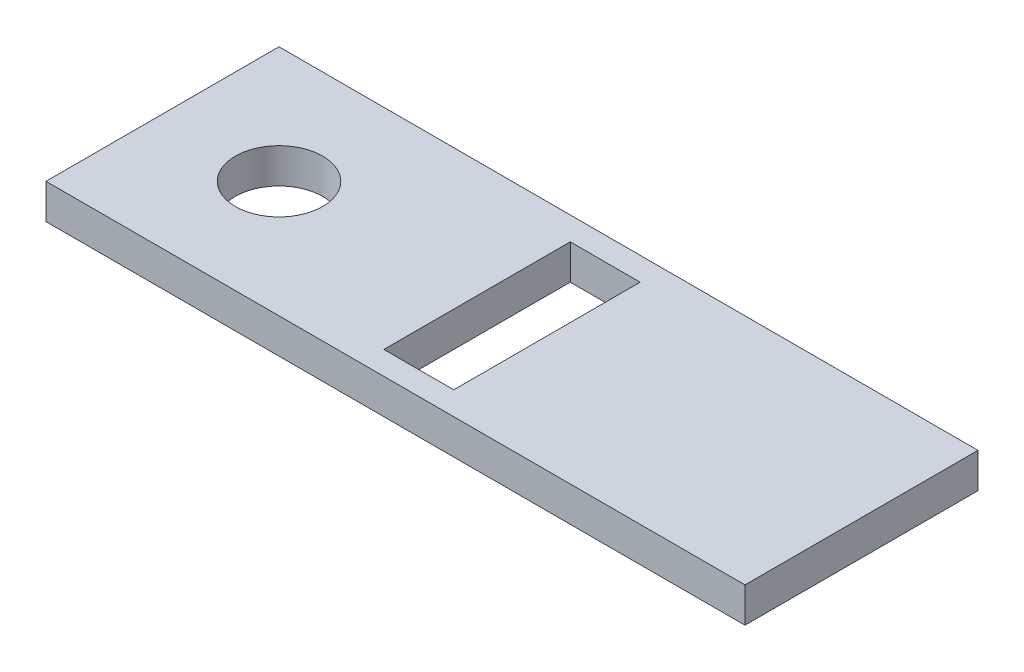
ISO-10303-21;
HEADER;
FILE_DESCRIPTION(('STEP AP214'),'2;1');
FILE_NAME('part.step','',(''),(''),'','','');
FILE_SCHEMA(('AUTOMOTIVE_DESIGN { 1 0 10303 214 1 1 1 1 }'));
ENDSEC;
DATA;
#1=APPLICATION_CONTEXT('core data for automotive mechanical design processes');
#2=APPLICATION_PROTOCOL_DEFINITION('international standard','automotive_design',2000,#1);
#3=PRODUCT_CONTEXT('',#1,'mechanical');
#4=PRODUCT('Part','Part','',(#3));
#5=PRODUCT_RELATED_PRODUCT_CATEGORY('part','',(#4));
#6=PRODUCT_DEFINITION_FORMATION('','',#4);
#7=PRODUCT_DEFINITION_CONTEXT('part definition',#1,'design');
#8=PRODUCT_DEFINITION('design','',#6,#7);
#9=PRODUCT_DEFINITION_SHAPE('','',#8);
#10=(LENGTH_UNIT() NAMED_UNIT(*) SI_UNIT(.MILLI.,.METRE.));
#11=(NAMED_UNIT(*) PLANE_ANGLE_UNIT() SI_UNIT($,.RADIAN.));
#12=(NAMED_UNIT(*) SI_UNIT($,.STERADIAN.) SOLID_ANGLE_UNIT());
#13=UNCERTAINTY_MEASURE_WITH_UNIT(LENGTH_MEASURE(1.E-05),#10,'distance_accuracy_value','');
#14=(GEOMETRIC_REPRESENTATION_CONTEXT(3) GLOBAL_UNCERTAINTY_ASSIGNED_CONTEXT((#13)) GLOBAL_UNIT_ASSIGNED_CONTEXT((#10,
#11,#12)) REPRESENTATION_CONTEXT('',''));
#15=CARTESIAN_POINT('',(0.,0.,0.));
#16=DIRECTION('',(0.,0.,1.));
#17=DIRECTION('',(1.,0.,0.));
#18=AXIS2_PLACEMENT_3D('',#15,#16,#17);
#19=CARTESIAN_POINT('',(-76.2,7.62,25.4));
#20=DIRECTION('',(-1.,0.,0.));
#21=DIRECTION('',(0.,0.,1.));
#22=AXIS2_PLACEMENT_3D('',#19,#20,#21);
#23=PLANE('',#22);
#24=DIRECTION('',(0.,0.,-1.));
#25=VECTOR('',#24,1.);
#26=CARTESIAN_POINT('',(-76.2,0.,25.4));
#27=LINE('',#26,#25);
#28=CARTESIAN_POINT('',(-76.2,0.,25.4));
#29=VERTEX_POINT('',#28);
#30=CARTESIAN_POINT('',(-76.2,0.,-25.4));
#31=VERTEX_POINT('',#30);
#32=EDGE_CURVE('E138',#29,#31,#27,.T.);
#33=ORIENTED_EDGE('',*,*,#32,.F.);
#34=DIRECTION('',(0.,-1.,0.));
#35=VECTOR('',#34,1.);
#36=CARTESIAN_POINT('',(-76.2,7.62,25.4));
#37=LINE('',#36,#35);
#38=CARTESIAN_POINT('',(-76.2,7.62,25.4));
#39=VERTEX_POINT('',#38);
#40=EDGE_CURVE('E11',#39,#29,#37,.T.);
#41=ORIENTED_EDGE('',*,*,#40,.F.);
#42=DIRECTION('',(0.,0.,-1.));
#43=VECTOR('',#42,1.);
#44=CARTESIAN_POINT('',(-76.2,7.62,25.4));
#45=LINE('',#44,#43);
#46=CARTESIAN_POINT('',(-76.2,7.62,-25.4));
#47=VERTEX_POINT('',#46);
#48=EDGE_CURVE('E141',#39,#47,#45,.T.);
#49=ORIENTED_EDGE('',*,*,#48,.T.);
#50=DIRECTION('',(0.,-1.,0.));
#51=VECTOR('',#50,1.);
#52=CARTESIAN_POINT('',(-76.2,7.62,-25.4));
#53=LINE('',#52,#51);
#54=EDGE_CURVE('E36',#47,#31,#53,.T.);
#55=ORIENTED_EDGE('',*,*,#54,.T.);
#56=EDGE_LOOP('',(#33,#41,#49,#55));
#57=FACE_BOUND('',#56,.T.);
#58=ADVANCED_FACE('F33',(#57),#23,.T.);
#59=CARTESIAN_POINT('',(-76.2,7.62,25.4));
#60=DIRECTION('',(0.,0.,-1.));
#61=DIRECTION('',(-1.,0.,0.));
#62=AXIS2_PLACEMENT_3D('',#59,#60,#61);
#63=PLANE('',#62);
#64=DIRECTION('',(1.,0.,0.));
#65=VECTOR('',#64,1.);
#66=CARTESIAN_POINT('',(-76.2,0.,25.4));
#67=LINE('',#66,#65);
#68=CARTESIAN_POINT('',(76.2,0.,25.4));
#69=VERTEX_POINT('',#68);
#70=EDGE_CURVE('E145',#29,#69,#67,.T.);
#71=ORIENTED_EDGE('',*,*,#70,.T.);
#72=DIRECTION('',(0.,-1.,0.));
#73=VECTOR('',#72,1.);
#74=CARTESIAN_POINT('',(76.2,7.62,25.4));
#75=LINE('',#74,#73);
#76=CARTESIAN_POINT('',(76.2,7.62,25.4));
#77=VERTEX_POINT('',#76);
#78=EDGE_CURVE('E41',#77,#69,#75,.T.);
#79=ORIENTED_EDGE('',*,*,#78,.F.);
#80=DIRECTION('',(1.,0.,0.));
#81=VECTOR('',#80,1.);
#82=CARTESIAN_POINT('',(-76.2,7.62,25.4));
#83=LINE('',#82,#81);
#84=EDGE_CURVE('E150',#39,#77,#83,.T.);
#85=ORIENTED_EDGE('',*,*,#84,.F.);
#86=ORIENTED_EDGE('',*,*,#40,.T.);
#87=EDGE_LOOP('',(#71,#79,#85,#86));
#88=FACE_BOUND('',#87,.T.);
#89=ADVANCED_FACE('F176',(#88),#63,.F.);
#90=CARTESIAN_POINT('',(76.2,7.62,25.4));
#91=DIRECTION('',(-1.,0.,0.));
#92=DIRECTION('',(0.,0.,1.));
#93=AXIS2_PLACEMENT_3D('',#90,#91,#92);
#94=PLANE('',#93);
#95=DIRECTION('',(0.,0.,-1.));
#96=VECTOR('',#95,1.);
#97=CARTESIAN_POINT('',(76.2,0.,25.4));
#98=LINE('',#97,#96);
#99=CARTESIAN_POINT('',(76.2,0.,-25.4));
#100=VERTEX_POINT('',#99);
#101=EDGE_CURVE('E157',#69,#100,#98,.T.);
#102=ORIENTED_EDGE('',*,*,#101,.T.);
#103=DIRECTION('',(0.,-1.,0.));
#104=VECTOR('',#103,1.);
#105=CARTESIAN_POINT('',(76.2,7.62,-25.4));
#106=LINE('',#105,#104);
#107=CARTESIAN_POINT('',(76.2,7.62,-25.4));
#108=VERTEX_POINT('',#107);
#109=EDGE_CURVE('E162',#108,#100,#106,.T.);
#110=ORIENTED_EDGE('',*,*,#109,.F.);
#111=DIRECTION('',(0.,0.,-1.));
#112=VECTOR('',#111,1.);
#113=CARTESIAN_POINT('',(76.2,7.62,25.4));
#114=LINE('',#113,#112);
#115=EDGE_CURVE('E148',#77,#108,#114,.T.);
#116=ORIENTED_EDGE('',*,*,#115,.F.);
#117=ORIENTED_EDGE('',*,*,#78,.T.);
#118=EDGE_LOOP('',(#102,#110,#116,#117));
#119=FACE_BOUND('',#118,.T.);
#120=ADVANCED_FACE('F180',(#119),#94,.F.);
#121=CARTESIAN_POINT('',(-76.2,7.62,-25.4));
#122=DIRECTION('',(0.,0.,-1.));
#123=DIRECTION('',(-1.,0.,0.));
#124=AXIS2_PLACEMENT_3D('',#121,#122,#123);
#125=PLANE('',#124);
#126=DIRECTION('',(1.,0.,0.));
#127=VECTOR('',#126,1.);
#128=CARTESIAN_POINT('',(-76.2,0.,-25.4));
#129=LINE('',#128,#127);
#130=EDGE_CURVE('E154',#31,#100,#129,.T.);
#131=ORIENTED_EDGE('',*,*,#130,.F.);
#132=ORIENTED_EDGE('',*,*,#54,.F.);
#133=DIRECTION('',(1.,0.,0.));
#134=VECTOR('',#133,1.);
#135=CARTESIAN_POINT('',(-76.2,7.62,-25.4));
#136=LINE('',#135,#134);
#137=EDGE_CURVE('E144',#47,#108,#136,.T.);
#138=ORIENTED_EDGE('',*,*,#137,.T.);
#139=ORIENTED_EDGE('',*,*,#109,.T.);
#140=EDGE_LOOP('',(#131,#132,#138,#139));
#141=FACE_BOUND('',#140,.T.);
#142=ADVANCED_FACE('F170',(#141),#125,.T.);
#143=CARTESIAN_POINT('',(0.,7.62,0.));
#144=DIRECTION('',(0.,-1.,0.));
#145=DIRECTION('',(0.,0.,-1.));
#146=AXIS2_PLACEMENT_3D('',#143,#144,#145);
#147=PLANE('',#146);
#148=DIRECTION('',(-1.,0.,0.));
#149=VECTOR('',#148,1.);
#150=CARTESIAN_POINT('',(-7.62,7.62,-20.32));
#151=LINE('',#150,#149);
#152=CARTESIAN_POINT('',(7.62,7.62,-20.32));
#153=VERTEX_POINT('',#152);
#154=CARTESIAN_POINT('',(-7.62,7.62,-20.32));
#155=VERTEX_POINT('',#154);
#156=EDGE_CURVE('E125',#153,#155,#151,.T.);
#157=ORIENTED_EDGE('',*,*,#156,.F.);
#158=DIRECTION('',(0.,0.,-1.));
#159=VECTOR('',#158,1.);
#160=CARTESIAN_POINT('',(7.62,7.62,20.32));
#161=LINE('',#160,#159);
#162=CARTESIAN_POINT('',(7.62,7.62,20.32));
#163=VERTEX_POINT('',#162);
#164=EDGE_CURVE('E49',#163,#153,#161,.T.);
#165=ORIENTED_EDGE('',*,*,#164,.F.);
#166=DIRECTION('',(1.,0.,0.));
#167=VECTOR('',#166,1.);
#168=CARTESIAN_POINT('',(-7.62,7.62,20.32));
#169=LINE('',#168,#167);
#170=CARTESIAN_POINT('',(-7.62,7.62,20.32));
#171=VERTEX_POINT('',#170);
#172=EDGE_CURVE('E116',#171,#163,#169,.T.);
#173=ORIENTED_EDGE('',*,*,#172,.F.);
#174=DIRECTION('',(0.,0.,1.));
#175=VECTOR('',#174,1.);
#176=CARTESIAN_POINT('',(-7.62,7.62,20.32));
#177=LINE('',#176,#175);
#178=EDGE_CURVE('E119',#155,#171,#177,.T.);
#179=ORIENTED_EDGE('',*,*,#178,.F.);
#180=EDGE_LOOP('',(#157,#165,#173,#179));
#181=FACE_BOUND('',#180,.T.);
#182=CARTESIAN_POINT('',(-50.8,7.62,0.));
#183=DIRECTION('',(0.,1.,0.));
#184=DIRECTION('',(0.,0.,1.));
#185=AXIS2_PLACEMENT_3D('',#182,#183,#184);
#186=CIRCLE('',#185,9.525);
#187=CARTESIAN_POINT('',(-50.8,7.62,9.525));
#188=VERTEX_POINT('',#187);
#189=EDGE_CURVE('E131',#188,#188,#186,.T.);
#190=ORIENTED_EDGE('',*,*,#189,.F.);
#191=EDGE_LOOP('',(#190));
#192=FACE_BOUND('',#191,.T.);
#193=ORIENTED_EDGE('',*,*,#48,.F.);
#194=ORIENTED_EDGE('',*,*,#84,.T.);
#195=ORIENTED_EDGE('',*,*,#115,.T.);
#196=ORIENTED_EDGE('',*,*,#137,.F.);
#197=EDGE_LOOP('',(#193,#194,#195,#196));
#198=FACE_BOUND('',#197,.T.);
#199=ADVANCED_FACE('F182',(#181,#192,#198),#147,.F.);
#200=CARTESIAN_POINT('',(0.,0.,0.));
#201=DIRECTION('',(0.,-1.,0.));
#202=DIRECTION('',(0.,0.,-1.));
#203=AXIS2_PLACEMENT_3D('',#200,#201,#202);
#204=PLANE('',#203);
#205=DIRECTION('',(0.,0.,-1.));
#206=VECTOR('',#205,1.);
#207=CARTESIAN_POINT('',(7.62,0.,20.32));
#208=LINE('',#207,#206);
#209=CARTESIAN_POINT('',(7.62,0.,20.32));
#210=VERTEX_POINT('',#209);
#211=CARTESIAN_POINT('',(7.62,0.,-20.32));
#212=VERTEX_POINT('',#211);
#213=EDGE_CURVE('E100',#210,#212,#208,.T.);
#214=ORIENTED_EDGE('',*,*,#213,.T.);
#215=DIRECTION('',(-1.,0.,0.));
#216=VECTOR('',#215,1.);
#217=CARTESIAN_POINT('',(-7.62,0.,-20.32));
#218=LINE('',#217,#216);
#219=CARTESIAN_POINT('',(-7.62,0.,-20.32));
#220=VERTEX_POINT('',#219);
#221=EDGE_CURVE('E109',#212,#220,#218,.T.);
#222=ORIENTED_EDGE('',*,*,#221,.T.);
#223=DIRECTION('',(0.,0.,1.));
#224=VECTOR('',#223,1.);
#225=CARTESIAN_POINT('',(-7.62,0.,20.32));
#226=LINE('',#225,#224);
#227=CARTESIAN_POINT('',(-7.62,0.,20.32));
#228=VERTEX_POINT('',#227);
#229=EDGE_CURVE('E57',#220,#228,#226,.T.);
#230=ORIENTED_EDGE('',*,*,#229,.T.);
#231=DIRECTION('',(1.,0.,0.));
#232=VECTOR('',#231,1.);
#233=CARTESIAN_POINT('',(-7.62,0.,20.32));
#234=LINE('',#233,#232);
#235=EDGE_CURVE('E106',#228,#210,#234,.T.);
#236=ORIENTED_EDGE('',*,*,#235,.T.);
#237=EDGE_LOOP('',(#214,#222,#230,#236));
#238=FACE_BOUND('',#237,.T.);
#239=CARTESIAN_POINT('',(-50.8,0.,0.));
#240=DIRECTION('',(0.,1.,0.));
#241=DIRECTION('',(0.,0.,1.));
#242=AXIS2_PLACEMENT_3D('',#239,#240,#241);
#243=CIRCLE('',#242,9.525);
#244=CARTESIAN_POINT('',(-50.8,0.,9.525));
#245=VERTEX_POINT('',#244);
#246=EDGE_CURVE('E135',#245,#245,#243,.T.);
#247=ORIENTED_EDGE('',*,*,#246,.T.);
#248=EDGE_LOOP('',(#247));
#249=FACE_BOUND('',#248,.T.);
#250=ORIENTED_EDGE('',*,*,#32,.T.);
#251=ORIENTED_EDGE('',*,*,#130,.T.);
#252=ORIENTED_EDGE('',*,*,#101,.F.);
#253=ORIENTED_EDGE('',*,*,#70,.F.);
#254=EDGE_LOOP('',(#250,#251,#252,#253));
#255=FACE_BOUND('',#254,.T.);
#256=ADVANCED_FACE('F113',(#238,#249,#255),#204,.T.);
#257=CARTESIAN_POINT('',(-50.8,0.,0.));
#258=DIRECTION('',(0.,1.,0.));
#259=DIRECTION('',(0.,0.,1.));
#260=AXIS2_PLACEMENT_3D('',#257,#258,#259);
#261=CYLINDRICAL_SURFACE('',#260,9.525);
#262=ORIENTED_EDGE('',*,*,#246,.F.);
#263=EDGE_LOOP('',(#262));
#264=FACE_BOUND('',#263,.T.);
#265=ORIENTED_EDGE('',*,*,#189,.T.);
#266=EDGE_LOOP('',(#265));
#267=FACE_BOUND('',#266,.T.);
#268=ADVANCED_FACE('F190',(#264,#267),#261,.F.);
#269=CARTESIAN_POINT('',(7.62,0.,20.32));
#270=DIRECTION('',(1.,0.,0.));
#271=DIRECTION('',(0.,0.,-1.));
#272=AXIS2_PLACEMENT_3D('',#269,#270,#271);
#273=PLANE('',#272);
#274=ORIENTED_EDGE('',*,*,#164,.T.);
#275=DIRECTION('',(0.,1.,0.));
#276=VECTOR('',#275,1.);
#277=CARTESIAN_POINT('',(7.62,0.,-20.32));
#278=LINE('',#277,#276);
#279=EDGE_CURVE('E96',#212,#153,#278,.T.);
#280=ORIENTED_EDGE('',*,*,#279,.F.);
#281=ORIENTED_EDGE('',*,*,#213,.F.);
#282=DIRECTION('',(0.,1.,0.));
#283=VECTOR('',#282,1.);
#284=CARTESIAN_POINT('',(7.62,0.,20.32));
#285=LINE('',#284,#283);
#286=EDGE_CURVE('E129',#210,#163,#285,.T.);
#287=ORIENTED_EDGE('',*,*,#286,.T.);
#288=EDGE_LOOP('',(#274,#280,#281,#287));
#289=FACE_BOUND('',#288,.T.);
#290=ADVANCED_FACE('F98',(#289),#273,.F.);
#291=CARTESIAN_POINT('',(-7.62,0.,20.32));
#292=DIRECTION('',(0.,0.,1.));
#293=DIRECTION('',(1.,0.,0.));
#294=AXIS2_PLACEMENT_3D('',#291,#292,#293);
#295=PLANE('',#294);
#296=ORIENTED_EDGE('',*,*,#172,.T.);
#297=ORIENTED_EDGE('',*,*,#286,.F.);
#298=ORIENTED_EDGE('',*,*,#235,.F.);
#299=DIRECTION('',(0.,1.,0.));
#300=VECTOR('',#299,1.);
#301=CARTESIAN_POINT('',(-7.62,0.,20.32));
#302=LINE('',#301,#300);
#303=EDGE_CURVE('E132',#228,#171,#302,.T.);
#304=ORIENTED_EDGE('',*,*,#303,.T.);
#305=EDGE_LOOP('',(#296,#297,#298,#304));
#306=FACE_BOUND('',#305,.T.);
#307=ADVANCED_FACE('F236',(#306),#295,.F.);
#308=CARTESIAN_POINT('',(-7.62,0.,20.32));
#309=DIRECTION('',(-1.,0.,0.));
#310=DIRECTION('',(0.,0.,1.));
#311=AXIS2_PLACEMENT_3D('',#308,#309,#310);
#312=PLANE('',#311);
#313=ORIENTED_EDGE('',*,*,#178,.T.);
#314=ORIENTED_EDGE('',*,*,#303,.F.);
#315=ORIENTED_EDGE('',*,*,#229,.F.);
#316=DIRECTION('',(0.,1.,0.));
#317=VECTOR('',#316,1.);
#318=CARTESIAN_POINT('',(-7.62,0.,-20.32));
#319=LINE('',#318,#317);
#320=EDGE_CURVE('E105',#220,#155,#319,.T.);
#321=ORIENTED_EDGE('',*,*,#320,.T.);
#322=EDGE_LOOP('',(#313,#314,#315,#321));
#323=FACE_BOUND('',#322,.T.);
#324=ADVANCED_FACE('F245',(#323),#312,.F.);
#325=CARTESIAN_POINT('',(-7.62,0.,-20.32));
#326=DIRECTION('',(0.,0.,-1.));
#327=DIRECTION('',(-1.,0.,0.));
#328=AXIS2_PLACEMENT_3D('',#325,#326,#327);
#329=PLANE('',#328);
#330=ORIENTED_EDGE('',*,*,#156,.T.);
#331=ORIENTED_EDGE('',*,*,#320,.F.);
#332=ORIENTED_EDGE('',*,*,#221,.F.);
#333=ORIENTED_EDGE('',*,*,#279,.T.);
#334=EDGE_LOOP('',(#330,#331,#332,#333));
#335=FACE_BOUND('',#334,.T.);
#336=ADVANCED_FACE('F110',(#335),#329,.F.);
#337=CLOSED_SHELL('',(#58,#89,#120,#142,#199,#256,#268,#290,#307,#324,#336));
#338=MANIFOLD_SOLID_BREP('B2',#337);
#339=ADVANCED_BREP_SHAPE_REPRESENTATION('',(#18,#338),#14);
#340=SHAPE_DEFINITION_REPRESENTATION(#9,#339);
ENDSEC;
END-ISO-10303-21;
